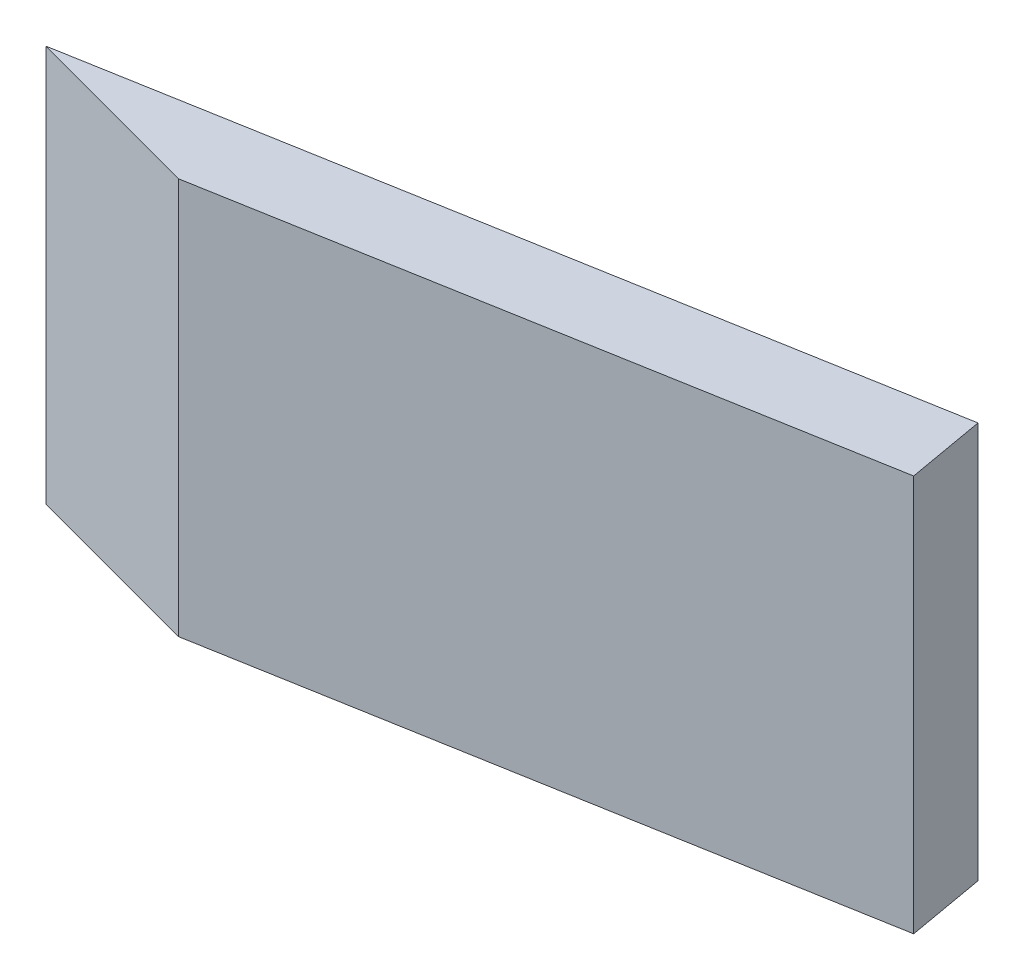
ISO-10303-21;
HEADER;
FILE_DESCRIPTION(('STEP AP214'),'2;1');
FILE_NAME('part.step','',(''),(''),'','','');
FILE_SCHEMA(('AUTOMOTIVE_DESIGN { 1 0 10303 214 1 1 1 1 }'));
ENDSEC;
DATA;
#1=APPLICATION_CONTEXT('core data for automotive mechanical design processes');
#2=APPLICATION_PROTOCOL_DEFINITION('international standard','automotive_design',2000,#1);
#3=PRODUCT_CONTEXT('',#1,'mechanical');
#4=PRODUCT('Part','Part','',(#3));
#5=PRODUCT_RELATED_PRODUCT_CATEGORY('part','',(#4));
#6=PRODUCT_DEFINITION_FORMATION('','',#4);
#7=PRODUCT_DEFINITION_CONTEXT('part definition',#1,'design');
#8=PRODUCT_DEFINITION('design','',#6,#7);
#9=PRODUCT_DEFINITION_SHAPE('','',#8);
#10=(LENGTH_UNIT() NAMED_UNIT(*) SI_UNIT(.MILLI.,.METRE.));
#11=(NAMED_UNIT(*) PLANE_ANGLE_UNIT() SI_UNIT($,.RADIAN.));
#12=(NAMED_UNIT(*) SI_UNIT($,.STERADIAN.) SOLID_ANGLE_UNIT());
#13=UNCERTAINTY_MEASURE_WITH_UNIT(LENGTH_MEASURE(1.E-05),#10,'distance_accuracy_value','');
#14=(GEOMETRIC_REPRESENTATION_CONTEXT(3) GLOBAL_UNCERTAINTY_ASSIGNED_CONTEXT((#13)) GLOBAL_UNIT_ASSIGNED_CONTEXT((#10,
#11,#12)) REPRESENTATION_CONTEXT('',''));
#15=CARTESIAN_POINT('',(0.,0.,0.));
#16=DIRECTION('',(0.,0.,1.));
#17=DIRECTION('',(1.,0.,0.));
#18=AXIS2_PLACEMENT_3D('',#15,#16,#17);
#19=CARTESIAN_POINT('',(14.5134026430193,31.75,3.88885451762473));
#20=DIRECTION('',(0.258819045102521,0.,-0.965925826289068));
#21=DIRECTION('',(-0.965925826289068,0.,-0.258819045102521));
#22=AXIS2_PLACEMENT_3D('',#19,#20,#21);
#23=PLANE('',#22);
#24=DIRECTION('',(0.965925826289068,0.,0.258819045102521));
#25=VECTOR('',#24,1.);
#26=CARTESIAN_POINT('',(14.5134026430193,0.,3.88885451762473));
#27=LINE('',#26,#25);
#28=CARTESIAN_POINT('',(0.,0.,0.));
#29=VERTEX_POINT('',#28);
#30=CARTESIAN_POINT('',(14.5134026430193,0.,3.88885451762473));
#31=VERTEX_POINT('',#30);
#32=EDGE_CURVE('E111',#29,#31,#27,.T.);
#33=ORIENTED_EDGE('',*,*,#32,.T.);
#34=DIRECTION('',(0.,-1.,0.));
#35=VECTOR('',#34,1.);
#36=CARTESIAN_POINT('',(14.5134026430193,31.75,3.88885451762473));
#37=LINE('',#36,#35);
#38=CARTESIAN_POINT('',(14.5134026430193,31.75,3.88885451762473));
#39=VERTEX_POINT('',#38);
#40=EDGE_CURVE('E11',#39,#31,#37,.T.);
#41=ORIENTED_EDGE('',*,*,#40,.F.);
#42=DIRECTION('',(0.965925826289068,0.,0.258819045102521));
#43=VECTOR('',#42,1.);
#44=CARTESIAN_POINT('',(14.5134026430193,31.75,3.88885451762473));
#45=LINE('',#44,#43);
#46=CARTESIAN_POINT('',(0.,31.75,0.));
#47=VERTEX_POINT('',#46);
#48=EDGE_CURVE('E95',#47,#39,#45,.T.);
#49=ORIENTED_EDGE('',*,*,#48,.F.);
#50=DIRECTION('',(0.,-1.,0.));
#51=VECTOR('',#50,1.);
#52=CARTESIAN_POINT('',(0.,31.75,0.));
#53=LINE('',#52,#51);
#54=EDGE_CURVE('E107',#47,#29,#53,.T.);
#55=ORIENTED_EDGE('',*,*,#54,.T.);
#56=EDGE_LOOP('',(#33,#41,#49,#55));
#57=FACE_BOUND('',#56,.T.);
#58=ADVANCED_FACE('F43',(#57),#23,.F.);
#59=CARTESIAN_POINT('',(64.5416364960395,31.75,-4.93247290785502));
#60=DIRECTION('',(-0.173648177666924,0.,-0.984807753012209));
#61=DIRECTION('',(-0.984807753012209,0.,0.173648177666924));
#62=AXIS2_PLACEMENT_3D('',#59,#60,#61);
#63=PLANE('',#62);
#64=DIRECTION('',(0.984807753012209,0.,-0.173648177666924));
#65=VECTOR('',#64,1.);
#66=CARTESIAN_POINT('',(64.5416364960395,0.,-4.93247290785502));
#67=LINE('',#66,#65);
#68=CARTESIAN_POINT('',(64.5416364960395,0.,-4.93247290785502));
#69=VERTEX_POINT('',#68);
#70=EDGE_CURVE('E100',#31,#69,#67,.T.);
#71=ORIENTED_EDGE('',*,*,#70,.T.);
#72=DIRECTION('',(0.,-1.,0.));
#73=VECTOR('',#72,1.);
#74=CARTESIAN_POINT('',(64.5416364960395,31.75,-4.93247290785502));
#75=LINE('',#74,#73);
#76=CARTESIAN_POINT('',(64.5416364960395,31.75,-4.93247290785502));
#77=VERTEX_POINT('',#76);
#78=EDGE_CURVE('E52',#77,#69,#75,.T.);
#79=ORIENTED_EDGE('',*,*,#78,.F.);
#80=DIRECTION('',(0.984807753012209,0.,-0.173648177666924));
#81=VECTOR('',#80,1.);
#82=CARTESIAN_POINT('',(64.5416364960395,31.75,-4.93247290785502));
#83=LINE('',#82,#81);
#84=EDGE_CURVE('E90',#39,#77,#83,.T.);
#85=ORIENTED_EDGE('',*,*,#84,.F.);
#86=ORIENTED_EDGE('',*,*,#40,.T.);
#87=EDGE_LOOP('',(#71,#79,#85,#86));
#88=FACE_BOUND('',#87,.T.);
#89=ADVANCED_FACE('F99',(#88),#63,.F.);
#90=CARTESIAN_POINT('',(63.4389705678545,31.75,-11.1860021394825));
#91=DIRECTION('',(-0.984807753012209,0.,0.173648177666923));
#92=DIRECTION('',(0.173648177666923,0.,0.984807753012209));
#93=AXIS2_PLACEMENT_3D('',#90,#91,#92);
#94=PLANE('',#93);
#95=DIRECTION('',(-0.173648177666923,0.,-0.984807753012209));
#96=VECTOR('',#95,1.);
#97=CARTESIAN_POINT('',(63.4389705678545,0.,-11.1860021394825));
#98=LINE('',#97,#96);
#99=CARTESIAN_POINT('',(63.4389705678545,0.,-11.1860021394825));
#100=VERTEX_POINT('',#99);
#101=EDGE_CURVE('E77',#69,#100,#98,.T.);
#102=ORIENTED_EDGE('',*,*,#101,.T.);
#103=DIRECTION('',(0.,-1.,0.));
#104=VECTOR('',#103,1.);
#105=CARTESIAN_POINT('',(63.4389705678545,31.75,-11.1860021394825));
#106=LINE('',#105,#104);
#107=CARTESIAN_POINT('',(63.4389705678545,31.75,-11.1860021394825));
#108=VERTEX_POINT('',#107);
#109=EDGE_CURVE('E102',#108,#100,#106,.T.);
#110=ORIENTED_EDGE('',*,*,#109,.F.);
#111=DIRECTION('',(-0.173648177666923,0.,-0.984807753012209));
#112=VECTOR('',#111,1.);
#113=CARTESIAN_POINT('',(63.4389705678545,31.75,-11.1860021394825));
#114=LINE('',#113,#112);
#115=EDGE_CURVE('E93',#77,#108,#114,.T.);
#116=ORIENTED_EDGE('',*,*,#115,.F.);
#117=ORIENTED_EDGE('',*,*,#78,.T.);
#118=EDGE_LOOP('',(#102,#110,#116,#117));
#119=FACE_BOUND('',#118,.T.);
#120=ADVANCED_FACE('F103',(#119),#94,.F.);
#121=CARTESIAN_POINT('',(0.,31.75,0.));
#122=DIRECTION('',(0.173648177666924,0.,0.984807753012209));
#123=DIRECTION('',(0.984807753012209,0.,-0.173648177666924));
#124=AXIS2_PLACEMENT_3D('',#121,#122,#123);
#125=PLANE('',#124);
#126=DIRECTION('',(-0.984807753012209,0.,0.173648177666924));
#127=VECTOR('',#126,1.);
#128=CARTESIAN_POINT('',(0.,0.,0.));
#129=LINE('',#128,#127);
#130=EDGE_CURVE('E83',#100,#29,#129,.T.);
#131=ORIENTED_EDGE('',*,*,#130,.T.);
#132=ORIENTED_EDGE('',*,*,#54,.F.);
#133=DIRECTION('',(-0.984807753012209,0.,0.173648177666924));
#134=VECTOR('',#133,1.);
#135=CARTESIAN_POINT('',(0.,31.75,0.));
#136=LINE('',#135,#134);
#137=EDGE_CURVE('E60',#108,#47,#136,.T.);
#138=ORIENTED_EDGE('',*,*,#137,.F.);
#139=ORIENTED_EDGE('',*,*,#109,.T.);
#140=EDGE_LOOP('',(#131,#132,#138,#139));
#141=FACE_BOUND('',#140,.T.);
#142=ADVANCED_FACE('F124',(#141),#125,.F.);
#143=CARTESIAN_POINT('',(0.,31.75,0.));
#144=DIRECTION('',(0.,1.,0.));
#145=DIRECTION('',(0.,0.,1.));
#146=AXIS2_PLACEMENT_3D('',#143,#144,#145);
#147=PLANE('',#146);
#148=ORIENTED_EDGE('',*,*,#48,.T.);
#149=ORIENTED_EDGE('',*,*,#84,.T.);
#150=ORIENTED_EDGE('',*,*,#115,.T.);
#151=ORIENTED_EDGE('',*,*,#137,.T.);
#152=EDGE_LOOP('',(#148,#149,#150,#151));
#153=FACE_BOUND('',#152,.T.);
#154=ADVANCED_FACE('F91',(#153),#147,.T.);
#155=CARTESIAN_POINT('',(0.,0.,0.));
#156=DIRECTION('',(0.,1.,0.));
#157=DIRECTION('',(0.,0.,1.));
#158=AXIS2_PLACEMENT_3D('',#155,#156,#157);
#159=PLANE('',#158);
#160=ORIENTED_EDGE('',*,*,#32,.F.);
#161=ORIENTED_EDGE('',*,*,#130,.F.);
#162=ORIENTED_EDGE('',*,*,#101,.F.);
#163=ORIENTED_EDGE('',*,*,#70,.F.);
#164=EDGE_LOOP('',(#160,#161,#162,#163));
#165=FACE_BOUND('',#164,.T.);
#166=ADVANCED_FACE('F127',(#165),#159,.F.);
#167=CLOSED_SHELL('',(#58,#89,#120,#142,#154,#166));
#168=MANIFOLD_SOLID_BREP('B2',#167);
#169=ADVANCED_BREP_SHAPE_REPRESENTATION('',(#18,#168),#14);
#170=SHAPE_DEFINITION_REPRESENTATION(#9,#169);
ENDSEC;
END-ISO-10303-21;
